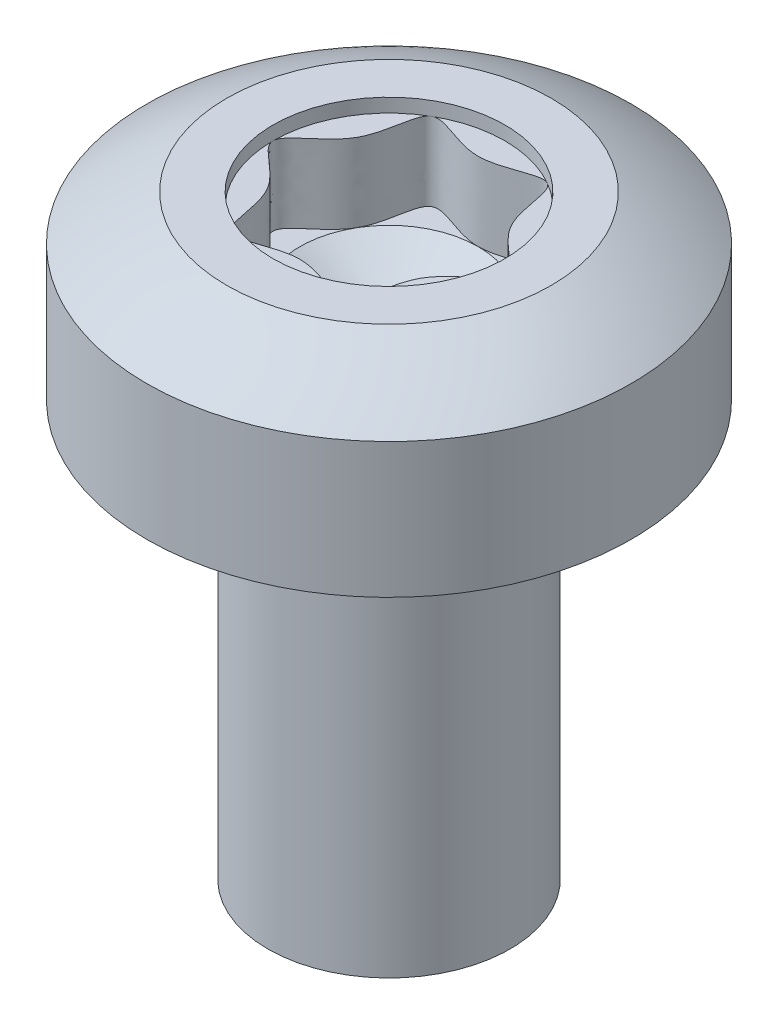
ISO-10303-21;
HEADER;
FILE_DESCRIPTION(('STEP AP214'),'2;1');
FILE_NAME('part.step','',(''),(''),'','','');
FILE_SCHEMA(('AUTOMOTIVE_DESIGN { 1 0 10303 214 1 1 1 1 }'));
ENDSEC;
DATA;
#1=APPLICATION_CONTEXT('core data for automotive mechanical design processes');
#2=APPLICATION_PROTOCOL_DEFINITION('international standard','automotive_design',2000,#1);
#3=PRODUCT_CONTEXT('',#1,'mechanical');
#4=PRODUCT('Part','Part','',(#3));
#5=PRODUCT_RELATED_PRODUCT_CATEGORY('part','',(#4));
#6=PRODUCT_DEFINITION_FORMATION('','',#4);
#7=PRODUCT_DEFINITION_CONTEXT('part definition',#1,'design');
#8=PRODUCT_DEFINITION('design','',#6,#7);
#9=PRODUCT_DEFINITION_SHAPE('','',#8);
#10=(LENGTH_UNIT() NAMED_UNIT(*) SI_UNIT(.MILLI.,.METRE.));
#11=(NAMED_UNIT(*) PLANE_ANGLE_UNIT() SI_UNIT($,.RADIAN.));
#12=(NAMED_UNIT(*) SI_UNIT($,.STERADIAN.) SOLID_ANGLE_UNIT());
#13=UNCERTAINTY_MEASURE_WITH_UNIT(LENGTH_MEASURE(1.E-05),#10,'distance_accuracy_value','');
#14=(GEOMETRIC_REPRESENTATION_CONTEXT(3) GLOBAL_UNCERTAINTY_ASSIGNED_CONTEXT((#13)) GLOBAL_UNIT_ASSIGNED_CONTEXT((#10,
#11,#12)) REPRESENTATION_CONTEXT('',''));
#15=CARTESIAN_POINT('',(0.,0.,0.));
#16=DIRECTION('',(0.,0.,1.));
#17=DIRECTION('',(1.,0.,0.));
#18=AXIS2_PLACEMENT_3D('',#15,#16,#17);
#19=CARTESIAN_POINT('',(0.,0.,0.));
#20=DIRECTION('',(0.,-1.,0.));
#21=DIRECTION('',(0.,0.,-1.));
#22=AXIS2_PLACEMENT_3D('',#19,#20,#21);
#23=CYLINDRICAL_SURFACE('',#22,3.5);
#24=CARTESIAN_POINT('',(0.,6.,0.));
#25=DIRECTION('',(0.,-1.,0.));
#26=DIRECTION('',(0.,0.,-1.));
#27=AXIS2_PLACEMENT_3D('',#24,#25,#26);
#28=CIRCLE('',#27,3.5);
#29=CARTESIAN_POINT('',(0.,6.,-3.5));
#30=VERTEX_POINT('',#29);
#31=EDGE_CURVE('E144',#30,#30,#28,.T.);
#32=ORIENTED_EDGE('',*,*,#31,.F.);
#33=EDGE_LOOP('',(#32));
#34=FACE_BOUND('',#33,.T.);
#35=CARTESIAN_POINT('',(0.,7.95,0.));
#36=DIRECTION('',(0.,-1.,0.));
#37=DIRECTION('',(0.,0.,-1.));
#38=AXIS2_PLACEMENT_3D('',#35,#36,#37);
#39=CIRCLE('',#38,3.5);
#40=CARTESIAN_POINT('',(0.,7.95,-3.5));
#41=VERTEX_POINT('',#40);
#42=EDGE_CURVE('E149',#41,#41,#39,.T.);
#43=ORIENTED_EDGE('',*,*,#42,.T.);
#44=EDGE_LOOP('',(#43));
#45=FACE_BOUND('',#44,.T.);
#46=ADVANCED_FACE('F42',(#34,#45),#23,.T.);
#47=CARTESIAN_POINT('',(1.75,6.,0.));
#48=DIRECTION('',(0.,-1.,0.));
#49=DIRECTION('',(0.,0.,-1.));
#50=AXIS2_PLACEMENT_3D('',#47,#48,#49);
#51=PLANE('',#50);
#52=ORIENTED_EDGE('',*,*,#31,.T.);
#53=EDGE_LOOP('',(#52));
#54=FACE_BOUND('',#53,.T.);
#55=CARTESIAN_POINT('',(0.,6.,0.));
#56=DIRECTION('',(0.,-1.,0.));
#57=DIRECTION('',(0.,0.,-1.));
#58=AXIS2_PLACEMENT_3D('',#55,#56,#57);
#59=CIRCLE('',#58,1.75);
#60=CARTESIAN_POINT('',(0.,6.,-1.75));
#61=VERTEX_POINT('',#60);
#62=EDGE_CURVE('E273',#61,#61,#59,.T.);
#63=ORIENTED_EDGE('',*,*,#62,.F.);
#64=EDGE_LOOP('',(#63));
#65=FACE_BOUND('',#64,.T.);
#66=ADVANCED_FACE('F295',(#54,#65),#51,.T.);
#67=CARTESIAN_POINT('',(0.,3.07660282759552,0.));
#68=DIRECTION('',(0.,-1.,0.));
#69=DIRECTION('',(1.,0.,0.));
#70=AXIS2_PLACEMENT_3D('',#67,#68,#69);
#71=SPHERICAL_SURFACE('',#70,6.);
#72=ORIENTED_EDGE('',*,*,#42,.F.);
#73=EDGE_LOOP('',(#72));
#74=FACE_BOUND('',#73,.T.);
#75=CARTESIAN_POINT('',(0.,8.6,0.));
#76=DIRECTION('',(0.,1.,0.));
#77=DIRECTION('',(0.,0.,1.));
#78=AXIS2_PLACEMENT_3D('',#75,#76,#77);
#79=CIRCLE('',#78,2.34351950618598);
#80=CARTESIAN_POINT('',(0.,8.6,2.34351950618598));
#81=VERTEX_POINT('',#80);
#82=EDGE_CURVE('E153',#81,#81,#79,.T.);
#83=ORIENTED_EDGE('',*,*,#82,.F.);
#84=EDGE_LOOP('',(#83));
#85=FACE_BOUND('',#84,.T.);
#86=ADVANCED_FACE('F291',(#74,#85),#71,.T.);
#87=CARTESIAN_POINT('',(3.5,8.6,0.));
#88=DIRECTION('',(0.,1.,0.));
#89=DIRECTION('',(0.,0.,1.));
#90=AXIS2_PLACEMENT_3D('',#87,#88,#89);
#91=PLANE('',#90);
#92=CARTESIAN_POINT('',(0.,8.6,0.));
#93=DIRECTION('',(0.,1.,0.));
#94=DIRECTION('',(0.,0.,1.));
#95=AXIS2_PLACEMENT_3D('',#92,#93,#94);
#96=CIRCLE('',#95,1.675);
#97=CARTESIAN_POINT('',(0.,8.6,1.675));
#98=VERTEX_POINT('',#97);
#99=EDGE_CURVE('E531',#98,#98,#96,.T.);
#100=ORIENTED_EDGE('',*,*,#99,.F.);
#101=EDGE_LOOP('',(#100));
#102=FACE_BOUND('',#101,.T.);
#103=ORIENTED_EDGE('',*,*,#82,.T.);
#104=EDGE_LOOP('',(#103));
#105=FACE_BOUND('',#104,.T.);
#106=ADVANCED_FACE('F294',(#102,#105),#91,.T.);
#107=CARTESIAN_POINT('',(0.,4.8,0.));
#108=DIRECTION('',(0.,-1.,0.));
#109=DIRECTION('',(0.,0.,-1.));
#110=AXIS2_PLACEMENT_3D('',#107,#108,#109);
#111=CONICAL_SURFACE('',#110,1.75,0.0597352460521102);
#112=CARTESIAN_POINT('',(0.,5.9,0.));
#113=DIRECTION('',(0.,-1.,0.));
#114=DIRECTION('',(0.,0.,-1.));
#115=AXIS2_PLACEMENT_3D('',#112,#113,#114);
#116=CIRCLE('',#115,1.68421296143363);
#117=CARTESIAN_POINT('',(0.,5.9,-1.68421296143363));
#118=VERTEX_POINT('',#117);
#119=EDGE_CURVE('E276',#118,#118,#116,.T.);
#120=ORIENTED_EDGE('',*,*,#119,.T.);
#121=EDGE_LOOP('',(#120));
#122=FACE_BOUND('',#121,.T.);
#123=CARTESIAN_POINT('',(0.,4.8,0.));
#124=DIRECTION('',(0.,-1.,0.));
#125=DIRECTION('',(0.,0.,-1.));
#126=AXIS2_PLACEMENT_3D('',#123,#124,#125);
#127=CIRCLE('',#126,1.75);
#128=CARTESIAN_POINT('',(0.,4.8,-1.75));
#129=VERTEX_POINT('',#128);
#130=EDGE_CURVE('E156',#129,#129,#127,.T.);
#131=ORIENTED_EDGE('',*,*,#130,.F.);
#132=EDGE_LOOP('',(#131));
#133=FACE_BOUND('',#132,.T.);
#134=ADVANCED_FACE('F300',(#122,#133),#111,.T.);
#135=CARTESIAN_POINT('',(0.,5.90596997268472,0.));
#136=DIRECTION('',(0.,-1.,0.));
#137=DIRECTION('',(0.,0.,-1.));
#138=AXIS2_PLACEMENT_3D('',#135,#136,#137);
#139=TOROIDAL_SURFACE('',#138,1.78403459949945,0.1);
#140=ORIENTED_EDGE('',*,*,#62,.T.);
#141=EDGE_LOOP('',(#140));
#142=FACE_BOUND('',#141,.T.);
#143=ORIENTED_EDGE('',*,*,#119,.F.);
#144=EDGE_LOOP('',(#143));
#145=FACE_BOUND('',#144,.T.);
#146=ADVANCED_FACE('F306',(#142,#145),#139,.F.);
#147=CARTESIAN_POINT('',(0.,0.,0.));
#148=DIRECTION('',(0.,-1.,0.));
#149=DIRECTION('',(0.,0.,-1.));
#150=AXIS2_PLACEMENT_3D('',#147,#148,#149);
#151=PLANE('',#150);
#152=CARTESIAN_POINT('',(0.,0.,0.));
#153=DIRECTION('',(0.,-1.,0.));
#154=DIRECTION('',(0.,0.,-1.));
#155=AXIS2_PLACEMENT_3D('',#152,#153,#154);
#156=CIRCLE('',#155,1.75);
#157=CARTESIAN_POINT('',(0.,0.,-1.75));
#158=VERTEX_POINT('',#157);
#159=EDGE_CURVE('E142',#158,#158,#156,.T.);
#160=ORIENTED_EDGE('',*,*,#159,.T.);
#161=EDGE_LOOP('',(#160));
#162=FACE_BOUND('',#161,.T.);
#163=ADVANCED_FACE('F44',(#162),#151,.T.);
#164=CARTESIAN_POINT('',(0.,0.,0.));
#165=DIRECTION('',(0.,-1.,0.));
#166=DIRECTION('',(0.,0.,-1.));
#167=AXIS2_PLACEMENT_3D('',#164,#165,#166);
#168=CYLINDRICAL_SURFACE('',#167,1.75);
#169=ORIENTED_EDGE('',*,*,#159,.F.);
#170=EDGE_LOOP('',(#169));
#171=FACE_BOUND('',#170,.T.);
#172=ORIENTED_EDGE('',*,*,#130,.T.);
#173=EDGE_LOOP('',(#172));
#174=FACE_BOUND('',#173,.T.);
#175=ADVANCED_FACE('F319',(#171,#174),#168,.T.);
#176=CARTESIAN_POINT('',(0.,8.4005,0.));
#177=DIRECTION('',(0.,1.,0.));
#178=DIRECTION('',(0.,0.,1.));
#179=AXIS2_PLACEMENT_3D('',#176,#177,#178);
#180=CYLINDRICAL_SURFACE('',#179,1.675);
#181=ORIENTED_EDGE('',*,*,#99,.T.);
#182=EDGE_LOOP('',(#181));
#183=FACE_BOUND('',#182,.T.);
#184=CARTESIAN_POINT('',(0.,8.4005,0.));
#185=DIRECTION('',(0.,1.,0.));
#186=DIRECTION('',(0.,0.,1.));
#187=AXIS2_PLACEMENT_3D('',#184,#185,#186);
#188=CIRCLE('',#187,1.675);
#189=CARTESIAN_POINT('',(-0.837499999999992,8.4005,1.45059255133894));
#190=VERTEX_POINT('',#189);
#191=CARTESIAN_POINT('',(0.837500000000008,8.4005,1.45059255133893));
#192=VERTEX_POINT('',#191);
#193=EDGE_CURVE('E125',#190,#192,#188,.T.);
#194=ORIENTED_EDGE('',*,*,#193,.F.);
#195=CARTESIAN_POINT('',(-1.675,8.4005,0.));
#196=VERTEX_POINT('',#195);
#197=EDGE_CURVE('E546',#196,#190,#188,.T.);
#198=ORIENTED_EDGE('',*,*,#197,.F.);
#199=CARTESIAN_POINT('',(-0.837500000000007,8.4005,-1.45059255133893));
#200=VERTEX_POINT('',#199);
#201=EDGE_CURVE('E548',#200,#196,#188,.T.);
#202=ORIENTED_EDGE('',*,*,#201,.F.);
#203=CARTESIAN_POINT('',(0.837499999999992,8.4005,-1.45059255133894));
#204=VERTEX_POINT('',#203);
#205=EDGE_CURVE('E118',#204,#200,#188,.T.);
#206=ORIENTED_EDGE('',*,*,#205,.F.);
#207=CARTESIAN_POINT('',(1.675,8.4005,0.));
#208=VERTEX_POINT('',#207);
#209=EDGE_CURVE('E108',#208,#204,#188,.T.);
#210=ORIENTED_EDGE('',*,*,#209,.F.);
#211=EDGE_CURVE('E60',#192,#208,#188,.T.);
#212=ORIENTED_EDGE('',*,*,#211,.F.);
#213=EDGE_LOOP('',(#194,#198,#202,#206,#210,#212));
#214=FACE_BOUND('',#213,.T.);
#215=ADVANCED_FACE('F115',(#183,#214),#180,.F.);
#216=CARTESIAN_POINT('',(0.,8.4005,0.));
#217=DIRECTION('',(0.,1.,0.));
#218=DIRECTION('',(0.,0.,1.));
#219=AXIS2_PLACEMENT_3D('',#216,#217,#218);
#220=PLANE('',#219);
#221=CARTESIAN_POINT('',(0.,8.4005,1.28846153846154));
#222=CARTESIAN_POINT('',(0.343716857829715,8.4005,1.28846153846154));
#223=CARTESIAN_POINT('',(1.03115057348914,8.4005,1.78600518353696));
#224=CARTESIAN_POINT('',(0.900397706043459,8.4005,0.519844857961908));
#225=CARTESIAN_POINT('',(2.06230114697827,8.4005,0.));
#226=CARTESIAN_POINT('',(0.900397706043456,8.4005,-0.519844857961915));
#227=CARTESIAN_POINT('',(1.03115057348913,8.4005,-1.78600518353697));
#228=CARTESIAN_POINT('',(0.,8.4005,-1.03968971592382));
#229=CARTESIAN_POINT('',(-1.03115057348914,8.4005,-1.78600518353696));
#230=CARTESIAN_POINT('',(-0.900397706043459,8.4005,-0.519844857961909));
#231=CARTESIAN_POINT('',(-2.06230114697827,8.4005,0.));
#232=CARTESIAN_POINT('',(-0.900397706043457,8.4005,0.519844857961914));
#233=CARTESIAN_POINT('',(-1.03115057348913,8.4005,1.78600518353697));
#234=CARTESIAN_POINT('',(-0.343716857829709,8.4005,1.28846153846154));
#235=CARTESIAN_POINT('',(0.,8.4005,1.28846153846154));
#236=B_SPLINE_CURVE_WITH_KNOTS('',3,(#221,#222,#223,#224,#225,#226,#227,#228,#229,#230,#231,
#232,#233,#234,#235),.UNSPECIFIED.,.T.,.F.,(4,1,1,1,1,1,1,1,1,1,1,1,4),(0.,0.0833333333333341,
0.166666666666667,0.250000000000001,0.333333333333333,0.416666666666667,0.5,0.583333333333334,
0.666666666666667,0.750000000000001,0.833333333333333,0.916666666666667,1.),.UNSPECIFIED.);
#237=EDGE_CURVE('E11',#190,#196,#236,.F.);
#238=ORIENTED_EDGE('',*,*,#237,.T.);
#239=ORIENTED_EDGE('',*,*,#197,.T.);
#240=EDGE_LOOP('',(#238,#239));
#241=FACE_BOUND('',#240,.T.);
#242=ADVANCED_FACE('F326',(#241),#220,.T.);
#243=EDGE_CURVE('E53',#196,#200,#236,.F.);
#244=ORIENTED_EDGE('',*,*,#243,.T.);
#245=ORIENTED_EDGE('',*,*,#201,.T.);
#246=EDGE_LOOP('',(#244,#245));
#247=FACE_BOUND('',#246,.T.);
#248=ADVANCED_FACE('F398',(#247),#220,.T.);
#249=EDGE_CURVE('E112',#200,#204,#236,.F.);
#250=ORIENTED_EDGE('',*,*,#249,.T.);
#251=ORIENTED_EDGE('',*,*,#205,.T.);
#252=EDGE_LOOP('',(#250,#251));
#253=FACE_BOUND('',#252,.T.);
#254=ADVANCED_FACE('F410',(#253),#220,.T.);
#255=EDGE_CURVE('E106',#204,#208,#236,.F.);
#256=ORIENTED_EDGE('',*,*,#255,.T.);
#257=ORIENTED_EDGE('',*,*,#209,.T.);
#258=EDGE_LOOP('',(#256,#257));
#259=FACE_BOUND('',#258,.T.);
#260=ADVANCED_FACE('F107',(#259),#220,.T.);
#261=EDGE_CURVE('E113',#208,#192,#236,.F.);
#262=ORIENTED_EDGE('',*,*,#261,.T.);
#263=ORIENTED_EDGE('',*,*,#211,.T.);
#264=EDGE_LOOP('',(#262,#263));
#265=FACE_BOUND('',#264,.T.);
#266=ADVANCED_FACE('F122',(#265),#220,.T.);
#267=EDGE_CURVE('E46',#192,#190,#236,.F.);
#268=ORIENTED_EDGE('',*,*,#267,.T.);
#269=ORIENTED_EDGE('',*,*,#193,.T.);
#270=EDGE_LOOP('',(#268,#269));
#271=FACE_BOUND('',#270,.T.);
#272=ADVANCED_FACE('F401',(#271),#220,.T.);
#273=CARTESIAN_POINT('',(0.,7.27,0.));
#274=DIRECTION('',(0.,1.,0.));
#275=DIRECTION('',(0.,0.,1.));
#276=AXIS2_PLACEMENT_3D('',#273,#274,#275);
#277=PLANE('',#276);
#278=CARTESIAN_POINT('',(0.,7.27,0.));
#279=DIRECTION('',(0.,1.,0.));
#280=DIRECTION('',(0.86856830987318,0.,0.495569461411866));
#281=AXIS2_PLACEMENT_3D('',#278,#279,#280);
#282=CIRCLE('',#281,1.2884615384615);
#283=CARTESIAN_POINT('',(1.11918607688771,7.27,0.63856155511009));
#284=VERTEX_POINT('',#283);
#285=CARTESIAN_POINT('',(1.11726614641239,7.27,-0.641966642055632));
#286=VERTEX_POINT('',#285);
#287=EDGE_CURVE('E68',#284,#286,#282,.T.);
#288=ORIENTED_EDGE('',*,*,#287,.F.);
#289=CARTESIAN_POINT('',(1.11719984341811,7.27,-0.641886473913007));
#290=CARTESIAN_POINT('',(1.2897318845187,7.27,-0.345652447339429));
#291=CARTESIAN_POINT('',(2.05881695518701,7.27,-0.000650971475518981));
#292=CARTESIAN_POINT('',(1.29262873913147,7.27,0.344350504388401));
#293=CARTESIAN_POINT('',(1.1191584562156,7.27,0.638544312887061));
#294=B_SPLINE_CURVE_WITH_KNOTS('',3,(#289,#290,#291,#292,#293),.UNSPECIFIED.,.F.,.F.,(4,1,4),
(0.167198732680925,0.250313060457143,0.333114327776218),.UNSPECIFIED.);
#295=EDGE_CURVE('E270',#284,#286,#294,.F.);
#296=ORIENTED_EDGE('',*,*,#295,.T.);
#297=EDGE_LOOP('',(#288,#296));
#298=FACE_BOUND('',#297,.T.);
#299=ADVANCED_FACE('F177',(#298),#277,.T.);
#300=CARTESIAN_POINT('',(-0.000478834556904206,7.27,-1.28846090532218));
#301=CARTESIAN_POINT('',(0.348005128711932,7.27,-1.28860967393743));
#302=CARTESIAN_POINT('',(0.649447367020815,7.27,-1.11301618151514));
#303=CARTESIAN_POINT('',(0.949551612285862,7.27,-0.938202085081691));
#304=CARTESIAN_POINT('',(1.12121559226569,7.27,-0.635241280403725));
#305=B_SPLINE_CURVE_WITH_KNOTS('',2,(#300,#301,#302,#303,#304),.UNSPECIFIED.,.F.,.F.,(3,2,3),
(0.,0.5,1.),.UNSPECIFIED.);
#306=CARTESIAN_POINT('',(0.000525674192979515,7.27,-1.28846173881857));
#307=VERTEX_POINT('',#306);
#308=EDGE_CURVE('E124',#307,#286,#305,.T.);
#309=ORIENTED_EDGE('',*,*,#308,.T.);
#310=CARTESIAN_POINT('',(0.000105263436338275,7.27,-1.2884615462383));
#311=CARTESIAN_POINT('',(0.343787031436032,7.27,-1.28851232595178));
#312=CARTESIAN_POINT('',(1.03114612425332,7.27,-1.78596209885387));
#313=CARTESIAN_POINT('',(0.943867452773695,7.27,-0.940789115230267));
#314=CARTESIAN_POINT('',(1.11674522293579,7.27,-0.642667048090311));
#315=CARTESIAN_POINT('',(1.11719984341811,7.27,-0.641886473913006));
#316=B_SPLINE_CURVE_WITH_KNOTS('',3,(#310,#311,#312,#313,#314,#315),.UNSPECIFIED.,.F.,.F.,(4,1,
1,4),(0.333114327776218,0.416439154153078,0.499772487486412,0.499991493043527),.UNSPECIFIED.);
#317=EDGE_CURVE('E268',#286,#307,#316,.F.);
#318=ORIENTED_EDGE('',*,*,#317,.T.);
#319=EDGE_LOOP('',(#309,#318));
#320=FACE_BOUND('',#319,.T.);
#321=ADVANCED_FACE('F166',(#320),#277,.T.);
#322=CARTESIAN_POINT('',(0.,7.27,0.));
#323=DIRECTION('',(0.,1.,0.));
#324=DIRECTION('',(0.000407986124261433,0.,-0.999999916773658));
#325=AXIS2_PLACEMENT_3D('',#322,#323,#324);
#326=CIRCLE('',#325,1.2884615384615);
#327=CARTESIAN_POINT('',(-1.11120811014631,7.27,-0.652366623291085));
#328=VERTEX_POINT('',#327);
#329=EDGE_CURVE('E137',#307,#328,#326,.T.);
#330=ORIENTED_EDGE('',*,*,#329,.F.);
#331=CARTESIAN_POINT('',(-1.11120691930939,7.27,-0.65237869189336));
#332=CARTESIAN_POINT('',(-0.944758360414704,7.27,-0.949543555203783));
#333=CARTESIAN_POINT('',(-1.02802617153457,7.27,-1.78374383629468));
#334=CARTESIAN_POINT('',(-0.343681770017534,7.27,-1.28843614296874));
#335=CARTESIAN_POINT('',(7.01756243628624E-05,7.27,-1.288461541054));
#336=CARTESIAN_POINT('',(0.000105263436338275,7.27,-1.2884615462383));
#337=B_SPLINE_CURVE_WITH_KNOTS('',3,(#331,#332,#333,#334,#335,#336),.UNSPECIFIED.,.F.,.F.,(4,1,
1,4),(0.499991493043527,0.582567322566335,0.66590065589967,0.665909162856142),.UNSPECIFIED.);
#338=EDGE_CURVE('E244',#307,#328,#337,.F.);
#339=ORIENTED_EDGE('',*,*,#338,.T.);
#340=EDGE_LOOP('',(#330,#339));
#341=FACE_BOUND('',#340,.T.);
#342=ADVANCED_FACE('F176',(#341),#277,.T.);
#343=CARTESIAN_POINT('',(0.,7.27,0.));
#344=DIRECTION('',(0.,1.,0.));
#345=DIRECTION('',(-0.862369735105347,0.,-0.506279013958048));
#346=AXIS2_PLACEMENT_3D('',#343,#344,#345);
#347=CIRCLE('',#346,1.2884615384615);
#348=CARTESIAN_POINT('',(-1.11540806127161,7.27,0.645193192708956));
#349=VERTEX_POINT('',#348);
#350=EDGE_CURVE('E134',#328,#349,#347,.T.);
#351=ORIENTED_EDGE('',*,*,#350,.F.);
#352=CARTESIAN_POINT('',(-1.11531019157047,7.27,0.645150740434076));
#353=CARTESIAN_POINT('',(-1.11548670759156,7.27,0.644843951802174));
#354=CARTESIAN_POINT('',(-1.28730002680752,7.27,0.346741676667514));
#355=CARTESIAN_POINT('',(-2.06230114697827,7.27,0.));
#356=CARTESIAN_POINT('',(-1.28417826788585,7.27,-0.348138376484422));
#357=CARTESIAN_POINT('',(-1.11273382395385,7.27,-0.64965267003427));
#358=CARTESIAN_POINT('',(-1.11120691930939,7.27,-0.65237869189336));
#359=B_SPLINE_CURVE_WITH_KNOTS('',3,(#352,#353,#354,#355,#356,#357,#358),.UNSPECIFIED.,.F.,.F.,
(4,1,1,1,4),(0.665909162856142,0.665994975971104,0.749328309304437,0.832661642637771,
0.833419146448296),.UNSPECIFIED.);
#360=EDGE_CURVE('E236',#328,#349,#359,.F.);
#361=ORIENTED_EDGE('',*,*,#360,.T.);
#362=EDGE_LOOP('',(#351,#361));
#363=FACE_BOUND('',#362,.T.);
#364=ADVANCED_FACE('F243',(#363),#277,.T.);
#365=CARTESIAN_POINT('',(0.,7.27,0.));
#366=DIRECTION('',(0.,1.,0.));
#367=DIRECTION('',(-0.865617778941432,0.,0.500705363243198));
#368=AXIS2_PLACEMENT_3D('',#365,#366,#367);
#369=CIRCLE('',#368,1.2884615384615);
#370=CARTESIAN_POINT('',(-0.00108935256553982,7.27,1.28846072565449));
#371=VERTEX_POINT('',#370);
#372=EDGE_CURVE('E128',#349,#371,#369,.T.);
#373=ORIENTED_EDGE('',*,*,#372,.F.);
#374=CARTESIAN_POINT('',(-0.000612951624218094,7.27,1.28846180205134));
#375=CARTESIAN_POINT('',(-0.344125423846039,7.27,1.28875717714185));
#376=CARTESIAN_POINT('',(-1.03077083904324,7.27,1.78549833102667));
#377=CARTESIAN_POINT('',(-0.94407155233166,7.27,0.942767169441256));
#378=CARTESIAN_POINT('',(-1.11531019157047,7.27,0.645150740434076));
#379=B_SPLINE_CURVE_WITH_KNOTS('',3,(#374,#375,#376,#377,#378),.UNSPECIFIED.,.F.,.F.,(4,1,4),
(0.833419146448296,0.916702943557995,0.999950463776367),.UNSPECIFIED.);
#380=EDGE_CURVE('E228',#349,#371,#379,.F.);
#381=ORIENTED_EDGE('',*,*,#380,.T.);
#382=EDGE_LOOP('',(#373,#381));
#383=FACE_BOUND('',#382,.T.);
#384=ADVANCED_FACE('F179',(#383),#277,.T.);
#385=CARTESIAN_POINT('',(0.,7.27,0.));
#386=DIRECTION('',(0.,1.,0.));
#387=DIRECTION('',(-0.00108830352621492,0.,0.999999407797542));
#388=AXIS2_PLACEMENT_3D('',#385,#386,#387);
#389=CIRCLE('',#388,1.2884615384615);
#390=CARTESIAN_POINT('',(1.10428356190894,7.27,0.664534135054057));
#391=VERTEX_POINT('',#390);
#392=EDGE_CURVE('E130',#371,#391,#389,.T.);
#393=ORIENTED_EDGE('',*,*,#392,.F.);
#394=CARTESIAN_POINT('',(1.10447929509615,7.27,0.6646623749107));
#395=CARTESIAN_POINT('',(1.09946117047679,7.27,0.674032956149918));
#396=CARTESIAN_POINT('',(1.0946422850419,7.27,0.683508485263619));
#397=CARTESIAN_POINT('',(1.08537384851212,7.27,0.702649933964796));
#398=CARTESIAN_POINT('',(1.08092465535024,7.27,0.71231602710814));
#399=CARTESIAN_POINT('',(1.07237170565442,7.27,0.731810773407859));
#400=CARTESIAN_POINT('',(1.06826829829878,7.27,0.741639579172118));
#401=CARTESIAN_POINT('',(1.06038280083656,7.27,0.761432678896663));
#402=CARTESIAN_POINT('',(1.05660093791256,7.27,0.771397062975551));
#403=CARTESIAN_POINT('',(1.04570384986834,7.27,0.801445183932453));
#404=CARTESIAN_POINT('',(1.03903400418944,7.27,0.821691126553775));
#405=CARTESIAN_POINT('',(1.02669302544493,7.27,0.862395355323694));
#406=CARTESIAN_POINT('',(1.02101819289723,7.27,0.882852541950186));
#407=CARTESIAN_POINT('',(1.01047747669823,7.27,0.923766838301762));
#408=CARTESIAN_POINT('',(1.00560448779216,7.27,0.944222139748847));
#409=CARTESIAN_POINT('',(0.996473987370027,7.27,0.984916255837349));
#410=CARTESIAN_POINT('',(0.99220770633657,7.27,1.00515313281853));
#411=CARTESIAN_POINT('',(0.980244319075789,7.27,1.06430255064215));
#412=CARTESIAN_POINT('',(0.972993521613699,7.27,1.1033031127747));
#413=CARTESIAN_POINT('',(0.961958378997886,7.27,1.16055407286056));
#414=CARTESIAN_POINT('',(0.95837420487991,7.27,1.17884366812341));
#415=CARTESIAN_POINT('',(0.951029846613787,7.27,1.21434083458865));
#416=CARTESIAN_POINT('',(0.947290248592352,7.27,1.2315524874815));
#417=CARTESIAN_POINT('',(0.941284276091561,7.27,1.25683063152716));
#418=CARTESIAN_POINT('',(0.939274310034269,7.27,1.26495755754498));
#419=CARTESIAN_POINT('',(0.935134273691267,7.27,1.28085787917952));
#420=CARTESIAN_POINT('',(0.933011480512992,7.27,1.28863315384482));
#421=CARTESIAN_POINT('',(0.928620144119354,7.27,1.30380267312833));
#422=CARTESIAN_POINT('',(0.926360974403293,7.27,1.3111996049009));
#423=CARTESIAN_POINT('',(0.921670275237808,7.27,1.32558429167334));
#424=CARTESIAN_POINT('',(0.919250511481818,7.27,1.33257585338019));
#425=CARTESIAN_POINT('',(0.91421171677092,7.27,1.34612234758391));
#426=CARTESIAN_POINT('',(0.911607041864332,7.27,1.35268253667059));
#427=CARTESIAN_POINT('',(0.907480258519175,7.27,1.36228918777584));
#428=CARTESIAN_POINT('',(0.906096420883871,7.27,1.36539521282478));
#429=CARTESIAN_POINT('',(0.903270910728053,7.27,1.37148777106496));
#430=CARTESIAN_POINT('',(0.901831520381958,7.27,1.37447535821006));
#431=CARTESIAN_POINT('',(0.898891819367485,7.27,1.38032747640961));
#432=CARTESIAN_POINT('',(0.897393924764954,7.27,1.38319321791743));
#433=CARTESIAN_POINT('',(0.894334032055302,7.27,1.38879810584662));
#434=CARTESIAN_POINT('',(0.892774560763589,7.27,1.3915386274726));
#435=CARTESIAN_POINT('',(0.889588388615676,7.27,1.39688952017793));
#436=CARTESIAN_POINT('',(0.887964287410464,7.27,1.39950143443862));
#437=CARTESIAN_POINT('',(0.884645767393352,7.27,1.40459155346778));
#438=CARTESIAN_POINT('',(0.882953971085769,7.27,1.40707146276763));
#439=CARTESIAN_POINT('',(0.879497011065082,7.27,1.41189403825232));
#440=CARTESIAN_POINT('',(0.87773442936843,7.27,1.41423854909637));
#441=CARTESIAN_POINT('',(0.874132983382678,7.27,1.41878675828062));
#442=CARTESIAN_POINT('',(0.872296582337635,7.27,1.42099240254423));
#443=CARTESIAN_POINT('',(0.868544427501714,7.27,1.42525957234257));
#444=CARTESIAN_POINT('',(0.866630935759738,7.27,1.42732307576516));
#445=CARTESIAN_POINT('',(0.863687244094055,7.27,1.43031979948377));
#446=CARTESIAN_POINT('',(0.862700612011511,7.27,1.43129607443576));
#447=CARTESIAN_POINT('',(0.860706785356562,7.27,1.43321155358209));
#448=CARTESIAN_POINT('',(0.859699813239585,7.27,1.43415098876674));
#449=CARTESIAN_POINT('',(0.857664981686415,7.27,1.43599233985174));
#450=CARTESIAN_POINT('',(0.856637319143583,7.27,1.43689447328601));
#451=CARTESIAN_POINT('',(0.854560747983494,7.27,1.43866082119111));
#452=CARTESIAN_POINT('',(0.853512008701158,7.27,1.43952523458648));
#453=CARTESIAN_POINT('',(0.851392936860972,7.27,1.44121573529397));
#454=CARTESIAN_POINT('',(0.850322744151729,7.27,1.44204199780991));
#455=CARTESIAN_POINT('',(0.848160418873564,7.27,1.44365580042735));
#456=CARTESIAN_POINT('',(0.847068395316684,7.27,1.44444348651047));
#457=CARTESIAN_POINT('',(0.8448620585929,7.27,1.44597973560289));
#458=CARTESIAN_POINT('',(0.843747822860863,7.27,1.44672840977081));
#459=CARTESIAN_POINT('',(0.841496731482268,7.27,1.44818627369095));
#460=CARTESIAN_POINT('',(0.840359921578914,7.27,1.44889553404079));
#461=CARTESIAN_POINT('',(0.838063280859093,7.27,1.45027409001329));
#462=CARTESIAN_POINT('',(0.836903464848222,7.27,1.45094341029442));
#463=CARTESIAN_POINT('',(0.834560763765304,7.27,1.45224218963013));
#464=CARTESIAN_POINT('',(0.83337786443932,7.27,1.45287162296577));
#465=CARTESIAN_POINT('',(0.830989259819019,7.27,1.45409131419812));
#466=CARTESIAN_POINT('',(0.829783516013102,7.27,1.45468149663362));
#467=CARTESIAN_POINT('',(0.827349409238333,7.27,1.45582324848078));
#468=CARTESIAN_POINT('',(0.826120988534074,7.27,1.45637469473376));
#469=CARTESIAN_POINT('',(0.823641727583996,7.27,1.45743956703236));
#470=CARTESIAN_POINT('',(0.822390815281893,7.27,1.45795282519767));
#471=CARTESIAN_POINT('',(0.819866764968009,7.27,1.45894190152922));
#472=CARTESIAN_POINT('',(0.818593545079913,7.27,1.45941751053691));
#473=CARTESIAN_POINT('',(0.816025054510236,7.27,1.46033187026943));
#474=CARTESIAN_POINT('',(0.814729696101944,7.27,1.46077037450156));
#475=CARTESIAN_POINT('',(0.812117158666403,7.27,1.46161109123427));
#476=CARTESIAN_POINT('',(0.810799890019026,7.27,1.46201302404842));
#477=CARTESIAN_POINT('',(0.806798807393464,7.27,1.46317007355244));
#478=CARTESIAN_POINT('',(0.804097441046086,7.27,1.46386520499976));
#479=CARTESIAN_POINT('',(0.798610081379068,7.27,1.46511827081445));
#480=CARTESIAN_POINT('',(0.795823451657534,7.27,1.4656733819829));
#481=CARTESIAN_POINT('',(0.790166652636175,7.27,1.46665111462115));
#482=CARTESIAN_POINT('',(0.787295961123837,7.27,1.46707069416299));
#483=CARTESIAN_POINT('',(0.781472390479434,7.27,1.46778183164509));
#484=CARTESIAN_POINT('',(0.778519132430756,7.27,1.46807024456557));
#485=CARTESIAN_POINT('',(0.772531681140428,7.27,1.46852343504233));
#486=CARTESIAN_POINT('',(0.769497253986797,7.27,1.46868506246544));
#487=CARTESIAN_POINT('',(0.763348740525576,7.27,1.46888897114306));
#488=CARTESIAN_POINT('',(0.760234556382244,7.27,1.46892817281637));
#489=CARTESIAN_POINT('',(0.75392781802642,7.27,1.46889144739335));
#490=CARTESIAN_POINT('',(0.750735284984674,7.27,1.46881256689089));
#491=CARTESIAN_POINT('',(0.74427313549314,7.27,1.46854386544841));
#492=CARTESIAN_POINT('',(0.741003638059403,7.27,1.4683512560134));
#493=CARTESIAN_POINT('',(0.734388960313868,7.27,1.46785917133444));
#494=CARTESIAN_POINT('',(0.731043977930462,7.27,1.46755709428552));
#495=CARTESIAN_POINT('',(0.720770608967476,7.27,1.46648390366982));
#496=CARTESIAN_POINT('',(0.713858245237964,7.27,1.46555779557271));
#497=CARTESIAN_POINT('',(0.699747169983749,7.27,1.46333705294777));
#498=CARTESIAN_POINT('',(0.692551038862002,7.27,1.46202657366419));
#499=CARTESIAN_POINT('',(0.677882609388061,7.27,1.45906830580661));
#500=CARTESIAN_POINT('',(0.670412922533439,7.27,1.45740772472812));
#501=CARTESIAN_POINT('',(0.655209048078665,7.27,1.45378034305088));
#502=CARTESIAN_POINT('',(0.647477299376273,7.27,1.45180344500395));
#503=CARTESIAN_POINT('',(0.623460132406742,7.27,1.44534592077484));
#504=CARTESIAN_POINT('',(0.607264334944834,7.27,1.44053458140237));
#505=CARTESIAN_POINT('',(0.573949966454945,7.27,1.43010469295385));
#506=CARTESIAN_POINT('',(0.556841873236404,7.27,1.42445371165611));
#507=CARTESIAN_POINT('',(0.521798384534291,7.27,1.41259254762087));
#508=CARTESIAN_POINT('',(0.503867705894446,7.27,1.40636862257543));
#509=CARTESIAN_POINT('',(0.448019346625521,7.27,1.38692735909493));
#510=CARTESIAN_POINT('',(0.410119229747256,7.27,1.37365396143185));
#511=CARTESIAN_POINT('',(0.352181927764892,7.27,1.35462555792009));
#512=CARTESIAN_POINT('',(0.332326785285147,7.27,1.34832670633598));
#513=CARTESIAN_POINT('',(0.292161006737123,7.27,1.33624081871917));
#514=CARTESIAN_POINT('',(0.27184786519166,7.27,1.33046203876654));
#515=CARTESIAN_POINT('',(0.230902275276815,7.27,1.31970784564061));
#516=CARTESIAN_POINT('',(0.210268769024622,7.27,1.3147363753852));
#517=CARTESIAN_POINT('',(0.17912466541742,7.27,1.30807999249543));
#518=CARTESIAN_POINT('',(0.168699592811398,7.27,1.3059928435122));
#519=CARTESIAN_POINT('',(0.147792124851663,7.27,1.30212002239823));
#520=CARTESIAN_POINT('',(0.137309724215158,7.27,1.30033437855154));
#521=CARTESIAN_POINT('',(0.116299057458428,7.27,1.29709904444525));
#522=CARTESIAN_POINT('',(0.105770821045863,7.27,1.29564916235671));
#523=CARTESIAN_POINT('',(0.0846796145332651,7.27,1.29311982237435));
#524=CARTESIAN_POINT('',(0.0741166868661058,7.27,1.29204001432855));
#525=CARTESIAN_POINT('',(0.0529676703965008,7.27,1.29028521372922));
#526=CARTESIAN_POINT('',(0.0423816152872958,7.27,1.28960981772028));
#527=CARTESIAN_POINT('',(0.0211966098505581,7.27,1.28869813095551));
#528=CARTESIAN_POINT('',(0.0105976733854804,7.27,1.28846153873898));
#529=CARTESIAN_POINT('',(-5.10793228560754E-05,7.27,1.2884615384602));
#530=CARTESIAN_POINT('',(-0.000102158616369461,7.27,1.28846154395515));
#531=CARTESIAN_POINT('',(-0.000204317215898069,7.27,1.28846156592816));
#532=CARTESIAN_POINT('',(-0.000255396521913292,7.27,1.28846158240622));
#533=CARTESIAN_POINT('',(-0.000408634445299478,7.27,1.28846164831054));
#534=CARTESIAN_POINT('',(-0.000510793060973858,7.27,1.28846171420692));
#535=CARTESIAN_POINT('',(-0.000612951624219468,7.27,1.28846180205134));
#536=B_SPLINE_CURVE_WITH_KNOTS('',3,(#394,#395,#396,#397,#398,#399,#400,#401,#402,#403,#404,
#405,#406,#407,#408,#409,#410,#411,#412,#413,#414,#415,#416,#417,#418,#419,#420,#421,#422,#423,
#424,#425,#426,#427,#428,#429,#430,#431,#432,#433,#434,#435,#436,#437,#438,#439,#440,#441,#442,
#443,#444,#445,#446,#447,#448,#449,#450,#451,#452,#453,#454,#455,#456,#457,#458,#459,#460,#461,
#462,#463,#464,#465,#466,#467,#468,#469,#470,#471,#472,#473,#474,#475,#476,#477,#478,#479,#480,
#481,#482,#483,#484,#485,#486,#487,#488,#489,#490,#491,#492,#493,#494,#495,#496,#497,#498,#499,
#500,#501,#502,#503,#504,#505,#506,#507,#508,#509,#510,#511,#512,#513,#514,#515,#516,#517,#518,
#519,#520,#521,#522,#523,#524,#525,#526,#527,#528,#529,#530,#531,#532,#533,#534,#535),
.UNSPECIFIED.,.F.,.F.,(4,2,2,2,2,2,2,2,2,2,2,2,2,2,2,2,2,2,2,2,2,2,2,2,2,2,2,2,2,2,2,2,2,2,2,2,
2,2,2,2,2,2,2,2,2,2,2,2,2,2,2,2,2,2,2,2,2,2,2,2,2,2,2,2,2,2,2,2,2,2,4),(0.,0.0318843003828943,
0.0637991196566272,0.0957457900220366,0.127714847460348,0.191629359049309,0.255300949195584,
0.318373793977103,0.380414136153705,0.499414683461447,0.555326845937218,0.608157623014377,
0.633271114615296,0.657447800998045,0.680646190857226,0.702835882748564,0.724001194859047,
0.734200996685153,0.744148105301559,0.75384702758462,0.76330431186623,0.772528810719038,
0.7815319589619,0.790328058265245,0.798934555016748,0.807372292599205,0.811535806962563,
0.815666609894503,0.819768339103039,0.823844866551404,0.827900295770164,0.831938956799751,
0.835965398629747,0.839984379063902,0.844000851999853,0.848019888928589,0.852046441657633,
0.856085265717411,0.860140907696338,0.864217695134804,0.868319728993016,0.872450878620922,
0.880813981218426,0.889334218311174,0.898034191653594,0.906932998056921,0.916046460292994,
0.925387395024797,0.934965896076506,0.944789617050367,0.954864042457596,0.97577583298452,
0.997713095318549,1.02066446342202,1.04460279979992,1.0952727108477,1.14932121920372,
1.20626185466524,1.3267231805394,1.38920697903123,1.45255245901684,1.51619857480139,
1.54809079611144,1.57998600755422,1.61186295127338,1.64370965026059,1.67552452471677,
1.70731753406504,1.70747077198151,1.70762400990126,1.70793048576187),.UNSPECIFIED.);
#537=EDGE_CURVE('E239',#371,#391,#536,.F.);
#538=ORIENTED_EDGE('',*,*,#537,.T.);
#539=EDGE_LOOP('',(#393,#538));
#540=FACE_BOUND('',#539,.T.);
#541=ADVANCED_FACE('F458',(#540),#277,.T.);
#542=CARTESIAN_POINT('',(0.,6.52610638392877,0.));
#543=DIRECTION('',(0.,1.,0.));
#544=DIRECTION('',(0.,0.,1.));
#545=AXIS2_PLACEMENT_3D('',#542,#543,#544);
#546=CONICAL_SURFACE('',#545,0.,1.04719755119659);
#547=ORIENTED_EDGE('',*,*,#308,.F.);
#548=ORIENTED_EDGE('',*,*,#329,.T.);
#549=ORIENTED_EDGE('',*,*,#350,.T.);
#550=ORIENTED_EDGE('',*,*,#372,.T.);
#551=ORIENTED_EDGE('',*,*,#392,.T.);
#552=CARTESIAN_POINT('',(1.11915845621561,7.27,0.63854431288706));
#553=CARTESIAN_POINT('',(1.11804376745526,7.27,0.640434749255675));
#554=CARTESIAN_POINT('',(1.11301033425988,7.27,0.649060609701375));
#555=CARTESIAN_POINT('',(1.10815878495758,7.27,0.657791480861702));
#556=CARTESIAN_POINT('',(1.10447929509615,7.27,0.6646623749107));
#557=B_SPLINE_CURVE_WITH_KNOTS('',3,(#552,#553,#554,#555,#556),.UNSPECIFIED.,.F.,.F.,(4,1,4),
(0.164777425082906,0.165309491097165,0.167198732680925),.UNSPECIFIED.);
#558=EDGE_CURVE('E271',#391,#284,#557,.F.);
#559=ORIENTED_EDGE('',*,*,#558,.T.);
#560=ORIENTED_EDGE('',*,*,#287,.T.);
#561=EDGE_LOOP('',(#547,#548,#549,#550,#551,#559,#560));
#562=FACE_BOUND('',#561,.T.);
#563=CARTESIAN_POINT('',(0.,6.52610638392877,0.));
#564=VERTEX_POINT('',#563);
#565=VERTEX_LOOP('',#564);
#566=FACE_BOUND('',#565,.T.);
#567=ADVANCED_FACE('F180',(#562,#566),#546,.F.);
#568=CARTESIAN_POINT('',(0.,7.27,1.28846153846154));
#569=CARTESIAN_POINT('',(0.343716857829715,7.27,1.28846153846154));
#570=CARTESIAN_POINT('',(1.03115057348914,7.27,1.78600518353696));
#571=CARTESIAN_POINT('',(0.900397706043459,7.27,0.519844857961908));
#572=CARTESIAN_POINT('',(2.06230114697827,7.27,0.));
#573=CARTESIAN_POINT('',(0.900397706043456,7.27,-0.519844857961915));
#574=CARTESIAN_POINT('',(1.03115057348913,7.27,-1.78600518353697));
#575=CARTESIAN_POINT('',(0.,7.27,-1.03968971592382));
#576=CARTESIAN_POINT('',(-1.03115057348914,7.27,-1.78600518353696));
#577=CARTESIAN_POINT('',(-0.900397706043459,7.27,-0.519844857961909));
#578=CARTESIAN_POINT('',(-2.06230114697827,7.27,0.));
#579=CARTESIAN_POINT('',(-0.900397706043457,7.27,0.519844857961914));
#580=CARTESIAN_POINT('',(-1.03115057348913,7.27,1.78600518353697));
#581=CARTESIAN_POINT('',(-0.343716857829709,7.27,1.28846153846154));
#582=CARTESIAN_POINT('',(0.,7.27,1.28846153846154));
#583=B_SPLINE_CURVE_WITH_KNOTS('',3,(#568,#569,#570,#571,#572,#573,#574,#575,#576,#577,#578,
#579,#580,#581,#582),.UNSPECIFIED.,.T.,.F.,(4,1,1,1,1,1,1,1,1,1,1,1,4),(0.,0.0833333333333341,
0.166666666666667,0.250000000000001,0.333333333333333,0.416666666666667,0.5,0.583333333333334,
0.666666666666667,0.750000000000001,0.833333333333333,0.916666666666667,1.),.UNSPECIFIED.);
#584=DIRECTION('',(0.,1.,0.));
#585=VECTOR('',#584,1.);
#586=SURFACE_OF_LINEAR_EXTRUSION('',#583,#585);
#587=ORIENTED_EDGE('',*,*,#558,.F.);
#588=ORIENTED_EDGE('',*,*,#537,.F.);
#589=ORIENTED_EDGE('',*,*,#380,.F.);
#590=ORIENTED_EDGE('',*,*,#360,.F.);
#591=ORIENTED_EDGE('',*,*,#338,.F.);
#592=ORIENTED_EDGE('',*,*,#317,.F.);
#593=ORIENTED_EDGE('',*,*,#295,.F.);
#594=EDGE_LOOP('',(#587,#588,#589,#590,#591,#592,#593));
#595=FACE_BOUND('',#594,.T.);
#596=ORIENTED_EDGE('',*,*,#237,.F.);
#597=ORIENTED_EDGE('',*,*,#267,.F.);
#598=ORIENTED_EDGE('',*,*,#261,.F.);
#599=ORIENTED_EDGE('',*,*,#255,.F.);
#600=ORIENTED_EDGE('',*,*,#249,.F.);
#601=ORIENTED_EDGE('',*,*,#243,.F.);
#602=EDGE_LOOP('',(#596,#597,#598,#599,#600,#601));
#603=FACE_BOUND('',#602,.T.);
#604=ADVANCED_FACE('F127',(#595,#603),#586,.F.);
#605=CLOSED_SHELL('',(#46,#66,#86,#106,#134,#146,#163,#175,#215,#242,#248,#254,#260,#266,#272,
#299,#321,#342,#364,#384,#541,#567,#604));
#606=MANIFOLD_SOLID_BREP('B2',#605);
#607=ADVANCED_BREP_SHAPE_REPRESENTATION('',(#18,#606),#14);
#608=SHAPE_DEFINITION_REPRESENTATION(#9,#607);
ENDSEC;
END-ISO-10303-21;
